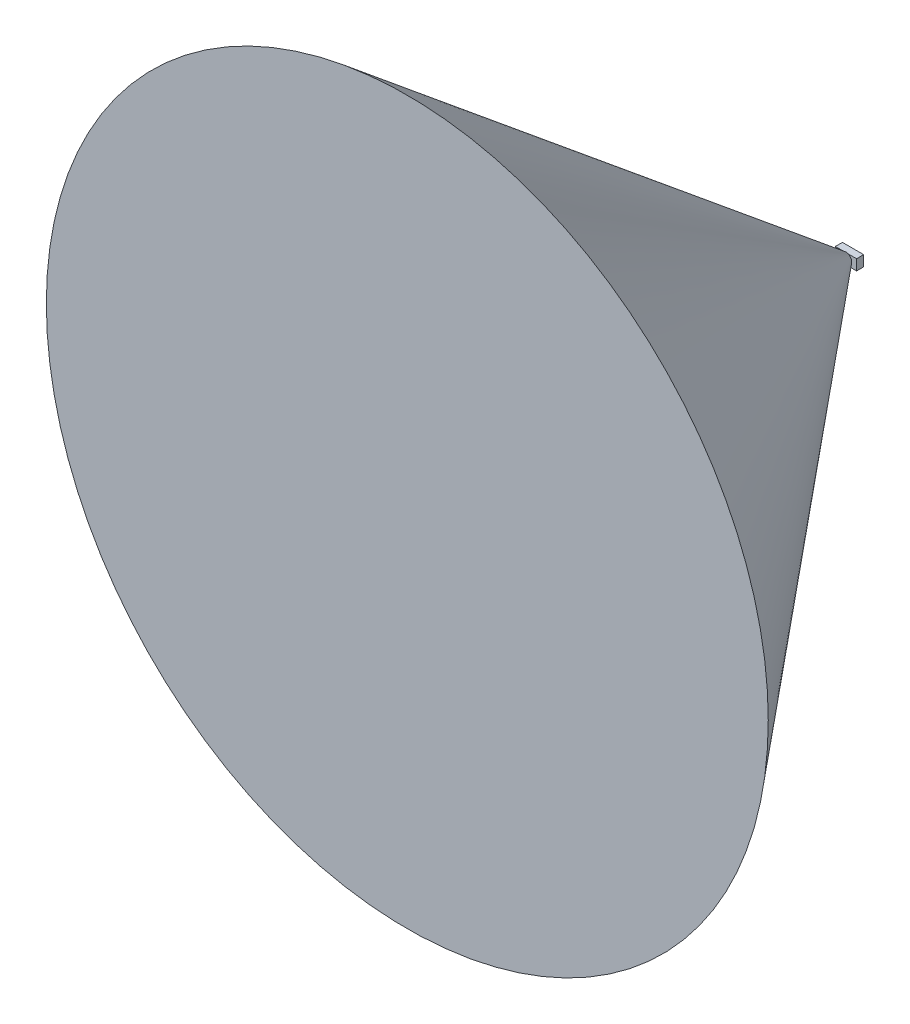
ISO-10303-21;
HEADER;
FILE_DESCRIPTION(('STEP AP214'),'2;1');
FILE_NAME('part.step','',(''),(''),'','','');
FILE_SCHEMA(('AUTOMOTIVE_DESIGN { 1 0 10303 214 1 1 1 1 }'));
ENDSEC;
DATA;
#1=APPLICATION_CONTEXT('core data for automotive mechanical design processes');
#2=APPLICATION_PROTOCOL_DEFINITION('international standard','automotive_design',2000,#1);
#3=PRODUCT_CONTEXT('',#1,'mechanical');
#4=PRODUCT('Part','Part','',(#3));
#5=PRODUCT_RELATED_PRODUCT_CATEGORY('part','',(#4));
#6=PRODUCT_DEFINITION_FORMATION('','',#4);
#7=PRODUCT_DEFINITION_CONTEXT('part definition',#1,'design');
#8=PRODUCT_DEFINITION('design','',#6,#7);
#9=PRODUCT_DEFINITION_SHAPE('','',#8);
#10=(LENGTH_UNIT() NAMED_UNIT(*) SI_UNIT(.MILLI.,.METRE.));
#11=(NAMED_UNIT(*) PLANE_ANGLE_UNIT() SI_UNIT($,.RADIAN.));
#12=(NAMED_UNIT(*) SI_UNIT($,.STERADIAN.) SOLID_ANGLE_UNIT());
#13=UNCERTAINTY_MEASURE_WITH_UNIT(LENGTH_MEASURE(1.E-05),#10,'distance_accuracy_value','');
#14=(GEOMETRIC_REPRESENTATION_CONTEXT(3) GLOBAL_UNCERTAINTY_ASSIGNED_CONTEXT((#13)) GLOBAL_UNIT_ASSIGNED_CONTEXT((#10,
#11,#12)) REPRESENTATION_CONTEXT('',''));
#15=CARTESIAN_POINT('',(0.,0.,0.));
#16=DIRECTION('',(0.,0.,1.));
#17=DIRECTION('',(1.,0.,0.));
#18=AXIS2_PLACEMENT_3D('',#15,#16,#17);
#19=CARTESIAN_POINT('',(19.05,-9.525,12.7));
#20=DIRECTION('',(0.,1.,0.));
#21=DIRECTION('',(-1.,0.,0.));
#22=AXIS2_PLACEMENT_3D('',#19,#20,#21);
#23=PLANE('',#22);
#24=CARTESIAN_POINT('',(-41.7329154663637,-9.52500000000001,52.8611262841384));
#25=CARTESIAN_POINT('',(-41.1841084167006,-9.52500000000001,52.2004000524092));
#26=CARTESIAN_POINT('',(-40.6349875482953,-9.52500000000001,51.5399345123754));
#27=CARTESIAN_POINT('',(-39.536030005168,-9.52500000000001,50.2195966967068));
#28=CARTESIAN_POINT('',(-38.9861933288156,-9.52500000000001,49.5597244224292));
#29=CARTESIAN_POINT('',(-37.3344189857981,-9.52500000000001,47.57983675476));
#30=CARTESIAN_POINT('',(-36.2312760161832,-9.52500000000001,46.260826183845));
#31=CARTESIAN_POINT('',(-33.9993537307711,-9.52500000000001,43.6006961543277));
#32=CARTESIAN_POINT('',(-32.8704928020584,-9.52500000000001,42.2596451425498));
#33=CARTESIAN_POINT('',(-30.6080898531251,-9.52500000000001,39.5836980335711));
#34=CARTESIAN_POINT('',(-29.4745533662483,-9.52500000000001,38.2487972640156));
#35=CARTESIAN_POINT('',(-27.4685114415837,-9.52500000000001,35.9006598308983));
#36=CARTESIAN_POINT('',(-26.5976661762715,-9.52500000000001,34.8860054696695));
#37=CARTESIAN_POINT('',(-24.8497998253679,-9.52500000000001,32.8618555463797));
#38=CARTESIAN_POINT('',(-23.9727781728883,-9.52500000000001,31.8523604729239));
#39=CARTESIAN_POINT('',(-22.6495194862806,-9.52500000000001,30.3417565303728));
#40=CARTESIAN_POINT('',(-22.2063627168987,-9.52500000000001,29.8379493022468));
#41=CARTESIAN_POINT('',(-21.3175978584252,-9.52500000000001,28.8325025334516));
#42=CARTESIAN_POINT('',(-20.8719897756553,-9.52500000000001,28.3308629871981));
#43=CARTESIAN_POINT('',(-19.9780192532587,-9.52500000000001,27.3303470860168));
#44=CARTESIAN_POINT('',(-19.5296577946701,-9.52500000000001,26.8314698551081));
#45=CARTESIAN_POINT('',(-18.629456866378,-9.52500000000001,25.8368653760331));
#46=CARTESIAN_POINT('',(-18.1776174158044,-9.52500000000001,25.3411381105685));
#47=CARTESIAN_POINT('',(-17.2766874538836,-9.52500000000001,24.361136414215));
#48=CARTESIAN_POINT('',(-16.8276611956301,-9.52500000000001,23.8768029819954));
#49=CARTESIAN_POINT('',(-15.9245925812118,-9.52500000000001,22.9128070373337));
#50=CARTESIAN_POINT('',(-15.4705501060147,-9.52500000000001,22.4331446362433));
#51=CARTESIAN_POINT('',(-14.5556181647284,-9.52500000000001,21.4790981577309));
#52=CARTESIAN_POINT('',(-14.0947200449479,-9.52500000000001,21.0047223600764));
#53=CARTESIAN_POINT('',(-13.1651072956501,-9.52500000000001,20.0637443627136));
#54=CARTESIAN_POINT('',(-12.6963932345662,-9.52500000000001,19.5971416025834));
#55=CARTESIAN_POINT('',(-11.7520090352601,-9.52500000000001,18.677237711095));
#56=CARTESIAN_POINT('',(-11.2764047905485,-9.52500000000001,18.2238693507253));
#57=CARTESIAN_POINT('',(-10.5531870050129,-9.52500000000001,17.5542318242145));
#58=CARTESIAN_POINT('',(-10.3104319986127,-9.52500000000001,17.3327139492846));
#59=CARTESIAN_POINT('',(-9.8211747684979,-9.52500000000001,16.8938612761206));
#60=CARTESIAN_POINT('',(-9.57467266030287,-9.525,16.6765263493965));
#61=CARTESIAN_POINT('',(-9.07793697705243,-9.525,16.2473776543236));
#62=CARTESIAN_POINT('',(-8.82771383499323,-9.525,16.0355518346014));
#63=CARTESIAN_POINT('',(-8.32225138399632,-9.525,15.6179194379334));
#64=CARTESIAN_POINT('',(-8.06701176348313,-9.525,15.4121132368565));
#65=CARTESIAN_POINT('',(-7.55090340456311,-9.525,15.0080379799494));
#66=CARTESIAN_POINT('',(-7.29003865928692,-9.525,14.8097638366096));
#67=CARTESIAN_POINT('',(-6.76160233541122,-9.525,14.4223964067649));
#68=CARTESIAN_POINT('',(-6.49403207313188,-9.525,14.2333013394466));
#69=CARTESIAN_POINT('',(-6.15216237989645,-9.525,14.0024087580726));
#70=CARTESIAN_POINT('',(-6.08147681211937,-9.525,13.9552332772822));
#71=CARTESIAN_POINT('',(-5.93955555540057,-9.525,13.8617049157473));
#72=CARTESIAN_POINT('',(-5.86831982522678,-9.525,13.8153520975331));
#73=CARTESIAN_POINT('',(-5.65373943961016,-9.525,13.6775915645559));
#74=CARTESIAN_POINT('',(-5.50954643729207,-9.525,13.5874985988721));
#75=CARTESIAN_POINT('',(-5.21871870131156,-9.525,13.4112670320085));
#76=CARTESIAN_POINT('',(-5.0720834630912,-9.525,13.3251292621225));
#77=CARTESIAN_POINT('',(-4.77625682026725,-9.525,13.1573635279396));
#78=CARTESIAN_POINT('',(-4.62706550475832,-9.525,13.0757354068717));
#79=CARTESIAN_POINT('',(-4.32773910370013,-9.525,12.9185130855149));
#80=CARTESIAN_POINT('',(-4.17763530718336,-9.525,12.8428596263156));
#81=CARTESIAN_POINT('',(-3.87471545066997,-9.525,12.6972155575557));
#82=CARTESIAN_POINT('',(-3.7218993277781,-9.525,12.6272250795219));
#83=CARTESIAN_POINT('',(-3.25932352666405,-9.525,12.4268628070908));
#84=CARTESIAN_POINT('',(-2.94528789605523,-9.525,12.306020653243));
#85=CARTESIAN_POINT('',(-2.40547628667111,-9.525,12.1288499322545));
#86=CARTESIAN_POINT('',(-2.18244329732998,-9.525,12.0641277621385));
#87=CARTESIAN_POINT('',(-1.73202422893885,-9.525,11.9521791873967));
#88=CARTESIAN_POINT('',(-1.50463929859137,-9.525,11.9049482311274));
#89=CARTESIAN_POINT('',(-1.04696021519912,-9.525,11.8299280309058));
#90=CARTESIAN_POINT('',(-0.816670330073242,-9.525,11.8021130326396));
#91=CARTESIAN_POINT('',(-0.354498600650761,-9.525,11.7670933563871));
#92=CARTESIAN_POINT('',(-0.122616701453188,-9.525,11.759889392792));
#93=CARTESIAN_POINT('',(0.341235970397746,-9.525,11.7664504945158));
#94=CARTESIAN_POINT('',(0.573206238434012,-9.525,11.7802507917391));
#95=CARTESIAN_POINT('',(1.03500400420548,-9.525,11.8282196676465));
#96=CARTESIAN_POINT('',(1.26483148202133,-9.525,11.8623884354844));
#97=CARTESIAN_POINT('',(1.72123316833611,-9.525,11.9496528933919));
#98=CARTESIAN_POINT('',(1.94780111530247,-9.525,12.0027809714939));
#99=CARTESIAN_POINT('',(2.39627701489066,-9.525,12.1259059745617));
#100=CARTESIAN_POINT('',(2.61818429601458,-9.525,12.1959053124184));
#101=CARTESIAN_POINT('',(3.19948118282119,-9.525,12.4008472951985));
#102=CARTESIAN_POINT('',(3.55442233128195,-9.525,12.5484186773318));
#103=CARTESIAN_POINT('',(4.25005246764212,-9.525,12.8740419005867));
#104=CARTESIAN_POINT('',(4.59072939496584,-9.525,13.0521189118606));
#105=CARTESIAN_POINT('',(5.09262112615243,-9.525,13.3367916790492));
#106=CARTESIAN_POINT('',(5.25876920961375,-9.525,13.4348546665146));
#107=CARTESIAN_POINT('',(5.58799578524646,-9.525,13.636017951801));
#108=CARTESIAN_POINT('',(5.75107424102514,-9.525,13.7391183092918));
#109=CARTESIAN_POINT('',(6.0743025535731,-9.525,13.9496342710546));
#110=CARTESIAN_POINT('',(6.23445374834693,-9.525,14.0570478282215));
#111=CARTESIAN_POINT('',(6.55212458824915,-9.525,14.2756776523342));
#112=CARTESIAN_POINT('',(6.70964431985409,-9.525,14.3868937939499));
#113=CARTESIAN_POINT('',(7.2034993707633,-9.525,14.7434969794526));
#114=CARTESIAN_POINT('',(7.53545006438269,-9.525,14.9949679366977));
#115=CARTESIAN_POINT('',(8.19014602210076,-9.525,15.509663297416));
#116=CARTESIAN_POINT('',(8.51288919805391,-9.525,15.7728903328317));
#117=CARTESIAN_POINT('',(9.15097252683827,-9.525,16.3086471643104));
#118=CARTESIAN_POINT('',(9.46630659748428,-9.525,16.5811841816211));
#119=CARTESIAN_POINT('',(10.0905787166414,-9.525,17.1334139321496));
#120=CARTESIAN_POINT('',(10.3995172606301,-9.525,17.4131061072572));
#121=CARTESIAN_POINT('',(11.0129207462306,-9.525,17.9790334981087));
#122=CARTESIAN_POINT('',(11.3173708732322,-9.525,18.265284734193));
#123=CARTESIAN_POINT('',(11.9217678518721,-9.525,18.842502957343));
#124=CARTESIAN_POINT('',(12.2217146307859,-9.525,19.1334700204074));
#125=CARTESIAN_POINT('',(12.8176549066079,-9.525,19.7191603210208));
#126=CARTESIAN_POINT('',(13.1136500752459,-9.525,20.0138818600065));
#127=CARTESIAN_POINT('',(13.7023750739859,-9.525,20.6065712141371));
#128=CARTESIAN_POINT('',(13.9951048619563,-9.525,20.9045390710696));
#129=CARTESIAN_POINT('',(14.8725984434818,-9.525,21.8061180572496));
#130=CARTESIAN_POINT('',(15.4531016115364,-9.525,22.413876617876));
#131=CARTESIAN_POINT('',(16.6056401452916,-9.525,23.6374471752618));
#132=CARTESIAN_POINT('',(17.1776746988256,-9.525,24.2532599339133));
#133=CARTESIAN_POINT('',(18.3141913811414,-9.525,25.4898791648062));
#134=CARTESIAN_POINT('',(18.8786846914873,-9.525,26.1106753735682));
#135=CARTESIAN_POINT('',(20.0024991934536,-9.525,27.3569342201384));
#136=CARTESIAN_POINT('',(20.5618203397875,-9.525,27.982396898719));
#137=CARTESIAN_POINT('',(22.0090431061266,-9.525,29.6115144957752));
#138=CARTESIAN_POINT('',(22.8937436482203,-9.525,30.618011692711));
#139=CARTESIAN_POINT('',(24.6555563522115,-9.525,32.6376400840133));
#140=CARTESIAN_POINT('',(25.5326683875979,-9.525,33.6507713884867));
#141=CARTESIAN_POINT('',(27.2817689753027,-9.525,35.682598407787));
#142=CARTESIAN_POINT('',(28.1537537972318,-9.525,36.701297331431));
#143=CARTESIAN_POINT('',(29.8933524310873,-9.525,38.7424201130892));
#144=CARTESIAN_POINT('',(30.7609662362083,-9.525,39.7648439768985));
#145=CARTESIAN_POINT('',(32.4744068553861,-9.525,41.7908802168135));
#146=CARTESIAN_POINT('',(33.3203055738281,-9.525,42.7944318136972));
#147=CARTESIAN_POINT('',(35.0094702830308,-9.525,44.8037512948005));
#148=CARTESIAN_POINT('',(35.852736267867,-9.525,45.8095191839989));
#149=CARTESIAN_POINT('',(37.5364968046829,-9.525,47.8220903631424));
#150=CARTESIAN_POINT('',(38.3769929601535,-9.525,48.8288923120528));
#151=CARTESIAN_POINT('',(40.0562016689388,-9.525,50.8439750286112));
#152=CARTESIAN_POINT('',(40.8949142302522,-9.525,51.852255789593));
#153=CARTESIAN_POINT('',(41.7329154663637,-9.525,52.8611262841384));
#154=B_SPLINE_CURVE_WITH_KNOTS('',3,(#24,#25,#26,#27,#28,#29,#30,#31,#32,#33,#34,#35,#36,#37,
#38,#39,#40,#41,#42,#43,#44,#45,#46,#47,#48,#49,#50,#51,#52,#53,#54,#55,#56,#57,#58,#59,#60,#61,
#62,#63,#64,#65,#66,#67,#68,#69,#70,#71,#72,#73,#74,#75,#76,#77,#78,#79,#80,#81,#82,#83,#84,#85,
#86,#87,#88,#89,#90,#91,#92,#93,#94,#95,#96,#97,#98,#99,#100,#101,#102,#103,#104,#105,#106,#107,
#108,#109,#110,#111,#112,#113,#114,#115,#116,#117,#118,#119,#120,#121,#122,#123,#124,#125,#126,
#127,#128,#129,#130,#131,#132,#133,#134,#135,#136,#137,#138,#139,#140,#141,#142,#143,#144,#145,
#146,#147,#148,#149,#150,#151,#152,#153),.UNSPECIFIED.,.F.,.F.,(4,2,2,2,2,2,2,2,2,2,2,2,2,2,2,2,
2,2,2,2,2,2,2,2,2,2,2,2,2,2,2,2,2,2,2,2,2,2,2,2,2,2,2,2,2,2,2,2,2,2,2,2,2,2,2,2,2,2,2,2,2,2,2,2,
4),(0.,2.57676811021704,5.15354209973714,10.3120639475885,15.5708270550092,20.8245424119483,
24.8358921718846,28.8476150332259,30.8605387136796,32.8734572053734,34.8856958856454,
36.8979235059547,38.8792660068841,40.8606556255363,42.8448042122556,44.8288091208603,
46.7997851556244,47.7856488167227,48.7714821460114,49.7549379233997,50.7384549778681,
51.7212954578946,52.7039444907008,52.9588868845134,53.2138485741356,53.7238619598118,
54.2339820527731,54.7440844010083,55.2482388083552,55.7524049216896,56.7602330363578,
57.4563492971855,58.1522842839653,58.847294383975,59.542328573174,60.2385298769603,
60.9347376461854,61.6321404798959,62.3296431138902,63.4807816553294,64.6328746150731,
65.2115886462018,65.7903095341019,66.3687589263232,66.9471892716849,68.1961402938786,
69.4453723459252,70.6955964012081,71.9457232332261,73.1993234782577,74.4529439459842,
75.7060160972366,76.9591043975289,79.4803246606387,82.0017851704195,84.5189611657754,
87.0361591802551,91.0562470525484,95.0764018166576,99.0991886314831,103.121981707484,
107.059480984651,110.996989116091,114.931546067219,118.866085336147),.UNSPECIFIED.);
#155=CARTESIAN_POINT('',(-3.8781853487872,-9.525,12.7));
#156=VERTEX_POINT('',#155);
#157=CARTESIAN_POINT('',(3.87818534878721,-9.525,12.7));
#158=VERTEX_POINT('',#157);
#159=EDGE_CURVE('E69',#156,#158,#154,.T.);
#160=ORIENTED_EDGE('',*,*,#159,.F.);
#161=DIRECTION('',(1.,0.,0.));
#162=VECTOR('',#161,1.);
#163=CARTESIAN_POINT('',(19.05,-9.525,12.7));
#164=LINE('',#163,#162);
#165=CARTESIAN_POINT('',(-19.05,-9.52500000000001,12.7));
#166=VERTEX_POINT('',#165);
#167=EDGE_CURVE('E169',#166,#156,#164,.T.);
#168=ORIENTED_EDGE('',*,*,#167,.F.);
#169=DIRECTION('',(0.,0.,-1.));
#170=VECTOR('',#169,1.);
#171=CARTESIAN_POINT('',(-19.05,-9.52500000000001,12.7));
#172=LINE('',#171,#170);
#173=CARTESIAN_POINT('',(-19.05,-9.52500000000001,0.));
#174=VERTEX_POINT('',#173);
#175=EDGE_CURVE('E116',#166,#174,#172,.T.);
#176=ORIENTED_EDGE('',*,*,#175,.T.);
#177=DIRECTION('',(1.,0.,0.));
#178=VECTOR('',#177,1.);
#179=CARTESIAN_POINT('',(19.05,-9.525,0.));
#180=LINE('',#179,#178);
#181=CARTESIAN_POINT('',(19.05,-9.525,0.));
#182=VERTEX_POINT('',#181);
#183=EDGE_CURVE('E148',#174,#182,#180,.T.);
#184=ORIENTED_EDGE('',*,*,#183,.T.);
#185=DIRECTION('',(0.,0.,-1.));
#186=VECTOR('',#185,1.);
#187=CARTESIAN_POINT('',(19.05,-9.525,12.7));
#188=LINE('',#187,#186);
#189=CARTESIAN_POINT('',(19.05,-9.525,12.7));
#190=VERTEX_POINT('',#189);
#191=EDGE_CURVE('E159',#190,#182,#188,.T.);
#192=ORIENTED_EDGE('',*,*,#191,.F.);
#193=EDGE_CURVE('E182',#158,#190,#164,.T.);
#194=ORIENTED_EDGE('',*,*,#193,.F.);
#195=EDGE_LOOP('',(#160,#168,#176,#184,#192,#194));
#196=FACE_BOUND('',#195,.T.);
#197=ADVANCED_FACE('F44',(#196),#23,.F.);
#198=CARTESIAN_POINT('',(19.05,9.525,12.7));
#199=DIRECTION('',(0.,-1.,0.));
#200=DIRECTION('',(1.,0.,0.));
#201=AXIS2_PLACEMENT_3D('',#198,#199,#200);
#202=PLANE('',#201);
#203=CARTESIAN_POINT('',(41.7329154663637,9.525,52.8611262841384));
#204=CARTESIAN_POINT('',(41.1841084167006,9.525,52.2004000524092));
#205=CARTESIAN_POINT('',(40.6349875482953,9.525,51.5399345123754));
#206=CARTESIAN_POINT('',(39.536030005168,9.525,50.2195966967068));
#207=CARTESIAN_POINT('',(38.9861933288156,9.525,49.5597244224292));
#208=CARTESIAN_POINT('',(37.3344189857981,9.525,47.57983675476));
#209=CARTESIAN_POINT('',(36.2312760161832,9.525,46.260826183845));
#210=CARTESIAN_POINT('',(33.9993537307711,9.525,43.6006961543277));
#211=CARTESIAN_POINT('',(32.8704928020584,9.525,42.2596451425498));
#212=CARTESIAN_POINT('',(30.6080898531251,9.525,39.5836980335711));
#213=CARTESIAN_POINT('',(29.4745533662483,9.525,38.2487972640156));
#214=CARTESIAN_POINT('',(27.4685114415837,9.525,35.9006598308983));
#215=CARTESIAN_POINT('',(26.5976661762715,9.525,34.8860054696695));
#216=CARTESIAN_POINT('',(24.8497998253679,9.525,32.8618555463797));
#217=CARTESIAN_POINT('',(23.9727781728883,9.525,31.8523604729239));
#218=CARTESIAN_POINT('',(22.6495194862806,9.525,30.3417565303728));
#219=CARTESIAN_POINT('',(22.2063627168987,9.525,29.8379493022468));
#220=CARTESIAN_POINT('',(21.3175978584252,9.525,28.8325025334517));
#221=CARTESIAN_POINT('',(20.8719897756553,9.525,28.3308629871981));
#222=CARTESIAN_POINT('',(19.9780192532587,9.525,27.3303470860168));
#223=CARTESIAN_POINT('',(19.5296577946701,9.525,26.8314698551081));
#224=CARTESIAN_POINT('',(18.629456866378,9.525,25.8368653760331));
#225=CARTESIAN_POINT('',(18.1776174158044,9.525,25.3411381105685));
#226=CARTESIAN_POINT('',(17.2766874538836,9.525,24.361136414215));
#227=CARTESIAN_POINT('',(16.8276611956301,9.525,23.8768029819954));
#228=CARTESIAN_POINT('',(15.9245925812118,9.525,22.9128070373337));
#229=CARTESIAN_POINT('',(15.4705501060147,9.525,22.4331446362433));
#230=CARTESIAN_POINT('',(14.5556181647284,9.525,21.4790981577309));
#231=CARTESIAN_POINT('',(14.0947200449479,9.525,21.0047223600764));
#232=CARTESIAN_POINT('',(13.1651072956501,9.525,20.0637443627136));
#233=CARTESIAN_POINT('',(12.6963932345662,9.525,19.5971416025834));
#234=CARTESIAN_POINT('',(11.7520090352601,9.525,18.677237711095));
#235=CARTESIAN_POINT('',(11.2764047905485,9.525,18.2238693507253));
#236=CARTESIAN_POINT('',(10.5531870050129,9.525,17.5542318242145));
#237=CARTESIAN_POINT('',(10.3104319986127,9.525,17.3327139492846));
#238=CARTESIAN_POINT('',(9.82117476849791,9.525,16.8938612761206));
#239=CARTESIAN_POINT('',(9.57467266030288,9.525,16.6765263493965));
#240=CARTESIAN_POINT('',(9.07793697705243,9.525,16.2473776543236));
#241=CARTESIAN_POINT('',(8.82771383499324,9.525,16.0355518346014));
#242=CARTESIAN_POINT('',(8.32225138399633,9.525,15.6179194379334));
#243=CARTESIAN_POINT('',(8.06701176348314,9.525,15.4121132368565));
#244=CARTESIAN_POINT('',(7.55090340456312,9.525,15.0080379799494));
#245=CARTESIAN_POINT('',(7.29003865928693,9.525,14.8097638366096));
#246=CARTESIAN_POINT('',(6.76160233541123,9.525,14.4223964067649));
#247=CARTESIAN_POINT('',(6.49403207313188,9.525,14.2333013394466));
#248=CARTESIAN_POINT('',(6.15216237989646,9.525,14.0024087580726));
#249=CARTESIAN_POINT('',(6.08147681211937,9.525,13.9552332772822));
#250=CARTESIAN_POINT('',(5.93955555540057,9.525,13.8617049157473));
#251=CARTESIAN_POINT('',(5.86831982522679,9.525,13.8153520975331));
#252=CARTESIAN_POINT('',(5.65373943961017,9.525,13.6775915645559));
#253=CARTESIAN_POINT('',(5.50954643729208,9.525,13.5874985988721));
#254=CARTESIAN_POINT('',(5.21871870131157,9.525,13.4112670320085));
#255=CARTESIAN_POINT('',(5.07208346309121,9.525,13.3251292621225));
#256=CARTESIAN_POINT('',(4.77625682026725,9.525,13.1573635279396));
#257=CARTESIAN_POINT('',(4.62706550475832,9.525,13.0757354068717));
#258=CARTESIAN_POINT('',(4.32773910370014,9.525,12.9185130855149));
#259=CARTESIAN_POINT('',(4.17763530718336,9.525,12.8428596263156));
#260=CARTESIAN_POINT('',(3.87471545066997,9.525,12.6972155575557));
#261=CARTESIAN_POINT('',(3.7218993277781,9.525,12.6272250795219));
#262=CARTESIAN_POINT('',(3.25932352666406,9.525,12.4268628070908));
#263=CARTESIAN_POINT('',(2.94528789605523,9.525,12.306020653243));
#264=CARTESIAN_POINT('',(2.40547628667111,9.525,12.1288499322545));
#265=CARTESIAN_POINT('',(2.18244329732998,9.525,12.0641277621385));
#266=CARTESIAN_POINT('',(1.73202422893885,9.525,11.9521791873967));
#267=CARTESIAN_POINT('',(1.50463929859137,9.525,11.9049482311274));
#268=CARTESIAN_POINT('',(1.04696021519912,9.525,11.8299280309058));
#269=CARTESIAN_POINT('',(0.81667033007325,9.525,11.8021130326396));
#270=CARTESIAN_POINT('',(0.35449860065077,9.525,11.7670933563871));
#271=CARTESIAN_POINT('',(0.122616701453196,9.525,11.759889392792));
#272=CARTESIAN_POINT('',(-0.341235970397736,9.525,11.7664504945158));
#273=CARTESIAN_POINT('',(-0.573206238433999,9.525,11.7802507917391));
#274=CARTESIAN_POINT('',(-1.03500400420547,9.525,11.8282196676465));
#275=CARTESIAN_POINT('',(-1.26483148202132,9.525,11.8623884354844));
#276=CARTESIAN_POINT('',(-1.7212331683361,9.525,11.9496528933918));
#277=CARTESIAN_POINT('',(-1.94780111530246,9.525,12.0027809714939));
#278=CARTESIAN_POINT('',(-2.39627701489065,9.525,12.1259059745617));
#279=CARTESIAN_POINT('',(-2.61818429601458,9.525,12.1959053124184));
#280=CARTESIAN_POINT('',(-3.19948118282118,9.525,12.4008472951985));
#281=CARTESIAN_POINT('',(-3.55442233128193,9.525,12.5484186773317));
#282=CARTESIAN_POINT('',(-4.25005246764209,9.525,12.8740419005866));
#283=CARTESIAN_POINT('',(-4.59072939496581,9.525,13.0521189118606));
#284=CARTESIAN_POINT('',(-5.0926211261524,9.525,13.3367916790492));
#285=CARTESIAN_POINT('',(-5.25876920961371,9.525,13.4348546665146));
#286=CARTESIAN_POINT('',(-5.58799578524643,9.525,13.636017951801));
#287=CARTESIAN_POINT('',(-5.7510742410251,9.525,13.7391183092918));
#288=CARTESIAN_POINT('',(-6.07430255357307,9.525,13.9496342710545));
#289=CARTESIAN_POINT('',(-6.23445374834691,9.525,14.0570478282215));
#290=CARTESIAN_POINT('',(-6.55212458824913,9.525,14.2756776523341));
#291=CARTESIAN_POINT('',(-6.70964431985407,9.525,14.3868937939499));
#292=CARTESIAN_POINT('',(-7.20349937076328,9.525,14.7434969794526));
#293=CARTESIAN_POINT('',(-7.53545006438266,9.525,14.9949679366977));
#294=CARTESIAN_POINT('',(-8.19014602210072,9.525,15.509663297416));
#295=CARTESIAN_POINT('',(-8.51288919805387,9.525,15.7728903328317));
#296=CARTESIAN_POINT('',(-9.15097252683823,9.525,16.3086471643104));
#297=CARTESIAN_POINT('',(-9.46630659748423,9.525,16.5811841816211));
#298=CARTESIAN_POINT('',(-10.0905787166413,9.525,17.1334139321495));
#299=CARTESIAN_POINT('',(-10.3995172606301,9.525,17.4131061072572));
#300=CARTESIAN_POINT('',(-11.0129207462306,9.525,17.9790334981087));
#301=CARTESIAN_POINT('',(-11.3173708732321,9.525,18.2652847341929));
#302=CARTESIAN_POINT('',(-11.9217678518721,9.525,18.842502957343));
#303=CARTESIAN_POINT('',(-12.2217146307858,9.525,19.1334700204073));
#304=CARTESIAN_POINT('',(-12.8176549066079,9.525,19.7191603210208));
#305=CARTESIAN_POINT('',(-13.1136500752459,9.525,20.0138818600065));
#306=CARTESIAN_POINT('',(-13.7023750739858,9.525,20.606571214137));
#307=CARTESIAN_POINT('',(-13.9951048619563,9.525,20.9045390710695));
#308=CARTESIAN_POINT('',(-14.8725984434817,9.525,21.8061180572496));
#309=CARTESIAN_POINT('',(-15.4531016115363,9.525,22.413876617876));
#310=CARTESIAN_POINT('',(-16.6056401452915,9.525,23.6374471752618));
#311=CARTESIAN_POINT('',(-17.1776746988256,9.525,24.2532599339133));
#312=CARTESIAN_POINT('',(-18.3141913811413,9.525,25.4898791648061));
#313=CARTESIAN_POINT('',(-18.8786846914872,9.525,26.1106753735681));
#314=CARTESIAN_POINT('',(-20.0024991934536,9.525,27.3569342201383));
#315=CARTESIAN_POINT('',(-20.5618203397874,9.525,27.9823968987189));
#316=CARTESIAN_POINT('',(-22.0090431061266,9.525,29.6115144957751));
#317=CARTESIAN_POINT('',(-22.8937436482202,9.525,30.6180116927109));
#318=CARTESIAN_POINT('',(-24.6555563522114,9.525,32.6376400840132));
#319=CARTESIAN_POINT('',(-25.5326683875979,9.525,33.6507713884867));
#320=CARTESIAN_POINT('',(-27.2817689753026,9.525,35.6825984077869));
#321=CARTESIAN_POINT('',(-28.1537537972317,9.52499999999999,36.7012973314309));
#322=CARTESIAN_POINT('',(-29.8933524310872,9.52499999999999,38.7424201130891));
#323=CARTESIAN_POINT('',(-30.7609662362083,9.52499999999999,39.7648439768984));
#324=CARTESIAN_POINT('',(-32.4744068553861,9.52499999999999,41.7908802168135));
#325=CARTESIAN_POINT('',(-33.3203055738281,9.52499999999999,42.7944318136972));
#326=CARTESIAN_POINT('',(-35.0094702830308,9.52499999999999,44.8037512948005));
#327=CARTESIAN_POINT('',(-35.852736267867,9.52499999999999,45.8095191839988));
#328=CARTESIAN_POINT('',(-37.5364968046829,9.52499999999999,47.8220903631424));
#329=CARTESIAN_POINT('',(-38.3769929601535,9.52499999999999,48.8288923120527));
#330=CARTESIAN_POINT('',(-40.0562016689388,9.52499999999999,50.8439750286111));
#331=CARTESIAN_POINT('',(-40.8949142302522,9.52499999999999,51.852255789593));
#332=CARTESIAN_POINT('',(-41.7329154663637,9.52499999999999,52.8611262841384));
#333=B_SPLINE_CURVE_WITH_KNOTS('',3,(#203,#204,#205,#206,#207,#208,#209,#210,#211,#212,#213,
#214,#215,#216,#217,#218,#219,#220,#221,#222,#223,#224,#225,#226,#227,#228,#229,#230,#231,#232,
#233,#234,#235,#236,#237,#238,#239,#240,#241,#242,#243,#244,#245,#246,#247,#248,#249,#250,#251,
#252,#253,#254,#255,#256,#257,#258,#259,#260,#261,#262,#263,#264,#265,#266,#267,#268,#269,#270,
#271,#272,#273,#274,#275,#276,#277,#278,#279,#280,#281,#282,#283,#284,#285,#286,#287,#288,#289,
#290,#291,#292,#293,#294,#295,#296,#297,#298,#299,#300,#301,#302,#303,#304,#305,#306,#307,#308,
#309,#310,#311,#312,#313,#314,#315,#316,#317,#318,#319,#320,#321,#322,#323,#324,#325,#326,#327,
#328,#329,#330,#331,#332),.UNSPECIFIED.,.F.,.F.,(4,2,2,2,2,2,2,2,2,2,2,2,2,2,2,2,2,2,2,2,2,2,2,
2,2,2,2,2,2,2,2,2,2,2,2,2,2,2,2,2,2,2,2,2,2,2,2,2,2,2,2,2,2,2,2,2,2,2,2,2,2,2,2,2,4),(0.,
2.57676811021705,5.15354209973715,10.3120639475885,15.5708270550092,20.8245424119483,
24.8358921718846,28.8476150332259,30.8605387136796,32.8734572053734,34.8856958856454,
36.8979235059547,38.8792660068841,40.8606556255364,42.8448042122557,44.8288091208603,
46.7997851556245,47.7856488167227,48.7714821460115,49.7549379233997,50.7384549778681,
51.7212954578946,52.7039444907008,52.9588868845134,53.2138485741356,53.7238619598118,
54.2339820527731,54.7440844010084,55.2482388083553,55.7524049216897,56.7602330363578,
57.4563492971856,58.1522842839653,58.847294383975,59.542328573174,60.2385298769603,
60.9347376461854,61.6321404798959,62.3296431138902,63.4807816553294,64.6328746150731,
65.2115886462018,65.7903095341019,66.3687589263232,66.9471892716849,68.1961402938785,
69.4453723459252,70.6955964012081,71.9457232332261,73.1993234782577,74.4529439459842,
75.7060160972366,76.9591043975289,79.4803246606387,82.0017851704194,84.5189611657753,
87.036159180255,91.0562470525484,95.0764018166575,99.099188631483,103.121981707483,
107.059480984651,110.996989116091,114.931546067219,118.866085336147),.UNSPECIFIED.);
#334=CARTESIAN_POINT('',(3.87818534878722,9.52499999999999,12.7));
#335=VERTEX_POINT('',#334);
#336=CARTESIAN_POINT('',(-3.87818534878721,9.525,12.7));
#337=VERTEX_POINT('',#336);
#338=EDGE_CURVE('E111',#335,#337,#333,.T.);
#339=ORIENTED_EDGE('',*,*,#338,.F.);
#340=DIRECTION('',(-1.,0.,0.));
#341=VECTOR('',#340,1.);
#342=CARTESIAN_POINT('',(19.05,9.525,12.7));
#343=LINE('',#342,#341);
#344=CARTESIAN_POINT('',(19.05,9.525,12.7));
#345=VERTEX_POINT('',#344);
#346=EDGE_CURVE('E122',#345,#335,#343,.T.);
#347=ORIENTED_EDGE('',*,*,#346,.F.);
#348=DIRECTION('',(0.,0.,-1.));
#349=VECTOR('',#348,1.);
#350=CARTESIAN_POINT('',(19.05,9.525,12.7));
#351=LINE('',#350,#349);
#352=CARTESIAN_POINT('',(19.05,9.525,0.));
#353=VERTEX_POINT('',#352);
#354=EDGE_CURVE('E138',#345,#353,#351,.T.);
#355=ORIENTED_EDGE('',*,*,#354,.T.);
#356=DIRECTION('',(-1.,0.,0.));
#357=VECTOR('',#356,1.);
#358=CARTESIAN_POINT('',(19.05,9.525,0.));
#359=LINE('',#358,#357);
#360=CARTESIAN_POINT('',(-19.05,9.525,0.));
#361=VERTEX_POINT('',#360);
#362=EDGE_CURVE('E154',#353,#361,#359,.T.);
#363=ORIENTED_EDGE('',*,*,#362,.T.);
#364=DIRECTION('',(0.,0.,-1.));
#365=VECTOR('',#364,1.);
#366=CARTESIAN_POINT('',(-19.05,9.525,12.7));
#367=LINE('',#366,#365);
#368=CARTESIAN_POINT('',(-19.05,9.525,12.7));
#369=VERTEX_POINT('',#368);
#370=EDGE_CURVE('E133',#369,#361,#367,.T.);
#371=ORIENTED_EDGE('',*,*,#370,.F.);
#372=EDGE_CURVE('E124',#337,#369,#343,.T.);
#373=ORIENTED_EDGE('',*,*,#372,.F.);
#374=EDGE_LOOP('',(#339,#347,#355,#363,#371,#373));
#375=FACE_BOUND('',#374,.T.);
#376=ADVANCED_FACE('F120',(#375),#202,.F.);
#377=CARTESIAN_POINT('',(0.,0.,12.7));
#378=DIRECTION('',(0.,0.,1.));
#379=DIRECTION('',(1.,0.,0.));
#380=AXIS2_PLACEMENT_3D('',#377,#378,#379);
#381=PLANE('',#380);
#382=ORIENTED_EDGE('',*,*,#167,.T.);
#383=CARTESIAN_POINT('',(0.,0.,12.7));
#384=DIRECTION('',(0.,0.,1.));
#385=DIRECTION('',(1.,0.,0.));
#386=AXIS2_PLACEMENT_3D('',#383,#384,#385);
#387=CIRCLE('',#386,10.2842572215765);
#388=EDGE_CURVE('E11',#156,#337,#387,.F.);
#389=ORIENTED_EDGE('',*,*,#388,.T.);
#390=ORIENTED_EDGE('',*,*,#372,.T.);
#391=DIRECTION('',(0.,-1.,0.));
#392=VECTOR('',#391,1.);
#393=CARTESIAN_POINT('',(-19.05,-9.52500000000001,12.7));
#394=LINE('',#393,#392);
#395=EDGE_CURVE('E156',#369,#166,#394,.T.);
#396=ORIENTED_EDGE('',*,*,#395,.T.);
#397=EDGE_LOOP('',(#382,#389,#390,#396));
#398=FACE_BOUND('',#397,.T.);
#399=ADVANCED_FACE('F194',(#398),#381,.T.);
#400=CARTESIAN_POINT('',(-19.05,-9.52500000000001,12.7));
#401=DIRECTION('',(1.,0.,0.));
#402=DIRECTION('',(0.,0.,-1.));
#403=AXIS2_PLACEMENT_3D('',#400,#401,#402);
#404=PLANE('',#403);
#405=DIRECTION('',(0.,-1.,0.));
#406=VECTOR('',#405,1.);
#407=CARTESIAN_POINT('',(-19.05,-9.52500000000001,0.));
#408=LINE('',#407,#406);
#409=EDGE_CURVE('E144',#361,#174,#408,.T.);
#410=ORIENTED_EDGE('',*,*,#409,.T.);
#411=ORIENTED_EDGE('',*,*,#175,.F.);
#412=ORIENTED_EDGE('',*,*,#395,.F.);
#413=ORIENTED_EDGE('',*,*,#370,.T.);
#414=EDGE_LOOP('',(#410,#411,#412,#413));
#415=FACE_BOUND('',#414,.T.);
#416=ADVANCED_FACE('F46',(#415),#404,.F.);
#417=CARTESIAN_POINT('',(19.05,-9.525,12.7));
#418=DIRECTION('',(-1.,0.,0.));
#419=DIRECTION('',(0.,0.,1.));
#420=AXIS2_PLACEMENT_3D('',#417,#418,#419);
#421=PLANE('',#420);
#422=DIRECTION('',(0.,1.,0.));
#423=VECTOR('',#422,1.);
#424=CARTESIAN_POINT('',(19.05,-9.525,0.));
#425=LINE('',#424,#423);
#426=EDGE_CURVE('E151',#182,#353,#425,.T.);
#427=ORIENTED_EDGE('',*,*,#426,.T.);
#428=ORIENTED_EDGE('',*,*,#354,.F.);
#429=DIRECTION('',(0.,1.,0.));
#430=VECTOR('',#429,1.);
#431=CARTESIAN_POINT('',(19.05,-9.525,12.7));
#432=LINE('',#431,#430);
#433=EDGE_CURVE('E130',#190,#345,#432,.T.);
#434=ORIENTED_EDGE('',*,*,#433,.F.);
#435=ORIENTED_EDGE('',*,*,#191,.T.);
#436=EDGE_LOOP('',(#427,#428,#434,#435));
#437=FACE_BOUND('',#436,.T.);
#438=ADVANCED_FACE('F179',(#437),#421,.F.);
#439=ORIENTED_EDGE('',*,*,#346,.T.);
#440=EDGE_CURVE('E48',#335,#158,#387,.F.);
#441=ORIENTED_EDGE('',*,*,#440,.T.);
#442=ORIENTED_EDGE('',*,*,#193,.T.);
#443=ORIENTED_EDGE('',*,*,#433,.T.);
#444=EDGE_LOOP('',(#439,#441,#442,#443));
#445=FACE_BOUND('',#444,.T.);
#446=ADVANCED_FACE('F128',(#445),#381,.T.);
#447=CARTESIAN_POINT('',(0.,0.,0.));
#448=DIRECTION('',(0.,0.,1.));
#449=DIRECTION('',(1.,0.,0.));
#450=AXIS2_PLACEMENT_3D('',#447,#448,#449);
#451=PLANE('',#450);
#452=CARTESIAN_POINT('',(0.,0.,0.));
#453=VERTEX_POINT('',#452);
#454=VERTEX_LOOP('',#453);
#455=FACE_BOUND('',#454,.T.);
#456=ORIENTED_EDGE('',*,*,#409,.F.);
#457=ORIENTED_EDGE('',*,*,#362,.F.);
#458=ORIENTED_EDGE('',*,*,#426,.F.);
#459=ORIENTED_EDGE('',*,*,#183,.F.);
#460=EDGE_LOOP('',(#456,#457,#458,#459));
#461=FACE_BOUND('',#460,.T.);
#462=ADVANCED_FACE('F176',(#455,#461),#451,.F.);
#463=CARTESIAN_POINT('',(0.,647.827226555999,800.));
#464=DIRECTION('',(0.,0.,-1.));
#465=DIRECTION('',(-1.,0.,0.));
#466=AXIS2_PLACEMENT_3D('',#463,#464,#465);
#467=PLANE('',#466);
#468=CARTESIAN_POINT('',(0.,0.,800.));
#469=DIRECTION('',(0.,0.,1.));
#470=DIRECTION('',(1.,0.,0.));
#471=AXIS2_PLACEMENT_3D('',#468,#469,#470);
#472=CIRCLE('',#471,647.827226555999);
#473=CARTESIAN_POINT('',(647.827226555999,0.,800.));
#474=VERTEX_POINT('',#473);
#475=EDGE_CURVE('E126',#474,#474,#472,.T.);
#476=ORIENTED_EDGE('',*,*,#475,.T.);
#477=EDGE_LOOP('',(#476));
#478=FACE_BOUND('',#477,.T.);
#479=ADVANCED_FACE('F219',(#478),#467,.F.);
#480=CARTESIAN_POINT('',(0.,0.,0.));
#481=DIRECTION('',(0.,0.,1.));
#482=DIRECTION('',(1.,0.,0.));
#483=AXIS2_PLACEMENT_3D('',#480,#481,#482);
#484=CONICAL_SURFACE('',#483,0.,0.680678408277783);
#485=ORIENTED_EDGE('',*,*,#388,.F.);
#486=ORIENTED_EDGE('',*,*,#159,.T.);
#487=ORIENTED_EDGE('',*,*,#440,.F.);
#488=ORIENTED_EDGE('',*,*,#338,.T.);
#489=EDGE_LOOP('',(#485,#486,#487,#488));
#490=FACE_BOUND('',#489,.T.);
#491=ORIENTED_EDGE('',*,*,#475,.F.);
#492=EDGE_LOOP('',(#491));
#493=FACE_BOUND('',#492,.T.);
#494=ADVANCED_FACE('F109',(#490,#493),#484,.T.);
#495=CLOSED_SHELL('',(#197,#376,#399,#416,#438,#446,#462,#479,#494));
#496=MANIFOLD_SOLID_BREP('B2',#495);
#497=ADVANCED_BREP_SHAPE_REPRESENTATION('',(#18,#496),#14);
#498=SHAPE_DEFINITION_REPRESENTATION(#9,#497);
ENDSEC;
END-ISO-10303-21;
